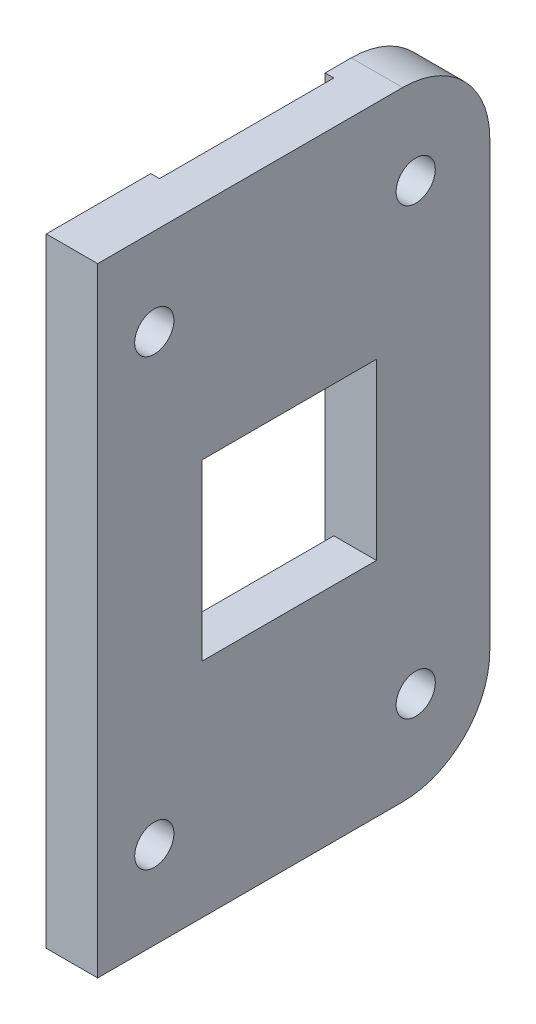
ISO-10303-21;
HEADER;
FILE_DESCRIPTION(('STEP AP214'),'2;1');
FILE_NAME('part.step','',(''),(''),'','','');
FILE_SCHEMA(('AUTOMOTIVE_DESIGN { 1 0 10303 214 1 1 1 1 }'));
ENDSEC;
DATA;
#1=APPLICATION_CONTEXT('core data for automotive mechanical design processes');
#2=APPLICATION_PROTOCOL_DEFINITION('international standard','automotive_design',2000,#1);
#3=PRODUCT_CONTEXT('',#1,'mechanical');
#4=PRODUCT('Part','Part','',(#3));
#5=PRODUCT_RELATED_PRODUCT_CATEGORY('part','',(#4));
#6=PRODUCT_DEFINITION_FORMATION('','',#4);
#7=PRODUCT_DEFINITION_CONTEXT('part definition',#1,'design');
#8=PRODUCT_DEFINITION('design','',#6,#7);
#9=PRODUCT_DEFINITION_SHAPE('','',#8);
#10=(LENGTH_UNIT() NAMED_UNIT(*) SI_UNIT(.MILLI.,.METRE.));
#11=(NAMED_UNIT(*) PLANE_ANGLE_UNIT() SI_UNIT($,.RADIAN.));
#12=(NAMED_UNIT(*) SI_UNIT($,.STERADIAN.) SOLID_ANGLE_UNIT());
#13=UNCERTAINTY_MEASURE_WITH_UNIT(LENGTH_MEASURE(1.E-05),#10,'distance_accuracy_value','');
#14=(GEOMETRIC_REPRESENTATION_CONTEXT(3) GLOBAL_UNCERTAINTY_ASSIGNED_CONTEXT((#13)) GLOBAL_UNIT_ASSIGNED_CONTEXT((#10,
#11,#12)) REPRESENTATION_CONTEXT('',''));
#15=CARTESIAN_POINT('',(0.,0.,0.));
#16=DIRECTION('',(0.,0.,1.));
#17=DIRECTION('',(1.,0.,0.));
#18=AXIS2_PLACEMENT_3D('',#15,#16,#17);
#19=CARTESIAN_POINT('',(0.999999999999998,71.001,-11.7999999999998));
#20=DIRECTION('',(1.,0.,0.));
#21=DIRECTION('',(0.,0.,-1.));
#22=AXIS2_PLACEMENT_3D('',#19,#20,#21);
#23=PLANE('',#22);
#24=DIRECTION('',(0.,-1.,0.));
#25=VECTOR('',#24,1.);
#26=CARTESIAN_POINT('',(0.999999999999998,71.001,8.20000000000018));
#27=LINE('',#26,#25);
#28=CARTESIAN_POINT('',(0.999999999999998,25.5,8.20000000000018));
#29=VERTEX_POINT('',#28);
#30=CARTESIAN_POINT('',(0.999999999999998,0.,8.20000000000018));
#31=VERTEX_POINT('',#30);
#32=EDGE_CURVE('E207',#29,#31,#27,.T.);
#33=ORIENTED_EDGE('',*,*,#32,.F.);
#34=DIRECTION('',(0.,0.,1.));
#35=VECTOR('',#34,1.);
#36=CARTESIAN_POINT('',(0.999999999999998,25.5,-11.7999999999998));
#37=LINE('',#36,#35);
#38=CARTESIAN_POINT('',(0.999999999999998,25.5,-11.7999999999998));
#39=VERTEX_POINT('',#38);
#40=EDGE_CURVE('E318',#39,#29,#37,.T.);
#41=ORIENTED_EDGE('',*,*,#40,.F.);
#42=DIRECTION('',(0.,-1.,0.));
#43=VECTOR('',#42,1.);
#44=CARTESIAN_POINT('',(0.999999999999998,71.001,-11.7999999999998));
#45=LINE('',#44,#43);
#46=CARTESIAN_POINT('',(0.999999999999998,0.,-11.7999999999998));
#47=VERTEX_POINT('',#46);
#48=EDGE_CURVE('E211',#39,#47,#45,.T.);
#49=ORIENTED_EDGE('',*,*,#48,.T.);
#50=DIRECTION('',(0.,0.,1.));
#51=VECTOR('',#50,1.);
#52=CARTESIAN_POINT('',(0.999999999999998,0.,-11.7999999999998));
#53=LINE('',#52,#51);
#54=EDGE_CURVE('E196',#47,#31,#53,.T.);
#55=ORIENTED_EDGE('',*,*,#54,.T.);
#56=EDGE_LOOP('',(#33,#41,#49,#55));
#57=FACE_BOUND('',#56,.T.);
#58=ADVANCED_FACE('F33',(#57),#23,.F.);
#59=CARTESIAN_POINT('',(0.,71.,-24.7999999999998));
#60=DIRECTION('',(1.,0.,0.));
#61=DIRECTION('',(0.,0.,-1.));
#62=AXIS2_PLACEMENT_3D('',#59,#60,#61);
#63=PLANE('',#62);
#64=CARTESIAN_POINT('',(0.,10.0000000000001,13.7000000000002));
#65=DIRECTION('',(1.,0.,0.));
#66=DIRECTION('',(0.,0.,-1.));
#67=AXIS2_PLACEMENT_3D('',#64,#65,#66);
#68=CIRCLE('',#67,2.24999999999995);
#69=CARTESIAN_POINT('',(0.,10.0000000000001,11.4500000000003));
#70=VERTEX_POINT('',#69);
#71=EDGE_CURVE('E167',#70,#70,#68,.F.);
#72=ORIENTED_EDGE('',*,*,#71,.F.);
#73=EDGE_LOOP('',(#72));
#74=FACE_BOUND('',#73,.T.);
#75=CARTESIAN_POINT('',(0.,61.0000000000001,13.7000000000002));
#76=DIRECTION('',(1.,0.,0.));
#77=DIRECTION('',(0.,0.,-1.));
#78=AXIS2_PLACEMENT_3D('',#75,#76,#77);
#79=CIRCLE('',#78,2.24999999999995);
#80=CARTESIAN_POINT('',(0.,61.0000000000001,11.4500000000003));
#81=VERTEX_POINT('',#80);
#82=EDGE_CURVE('E184',#81,#81,#79,.F.);
#83=ORIENTED_EDGE('',*,*,#82,.F.);
#84=EDGE_LOOP('',(#83));
#85=FACE_BOUND('',#84,.T.);
#86=DIRECTION('',(0.,0.,1.));
#87=VECTOR('',#86,1.);
#88=CARTESIAN_POINT('',(0.,71.,-24.7999999999998));
#89=LINE('',#88,#87);
#90=CARTESIAN_POINT('',(0.,71.,8.20000000000019));
#91=VERTEX_POINT('',#90);
#92=CARTESIAN_POINT('',(0.,71.,20.2000000000002));
#93=VERTEX_POINT('',#92);
#94=EDGE_CURVE('E220',#91,#93,#89,.T.);
#95=ORIENTED_EDGE('',*,*,#94,.F.);
#96=DIRECTION('',(0.,-1.,0.));
#97=VECTOR('',#96,1.);
#98=CARTESIAN_POINT('',(0.,71.001,8.20000000000018));
#99=LINE('',#98,#97);
#100=CARTESIAN_POINT('',(0.,0.,8.20000000000018));
#101=VERTEX_POINT('',#100);
#102=EDGE_CURVE('E202',#91,#101,#99,.T.);
#103=ORIENTED_EDGE('',*,*,#102,.T.);
#104=DIRECTION('',(0.,0.,1.));
#105=VECTOR('',#104,1.);
#106=CARTESIAN_POINT('',(0.,0.,-24.7999999999998));
#107=LINE('',#106,#105);
#108=CARTESIAN_POINT('',(0.,0.,20.2000000000002));
#109=VERTEX_POINT('',#108);
#110=EDGE_CURVE('E216',#101,#109,#107,.T.);
#111=ORIENTED_EDGE('',*,*,#110,.T.);
#112=DIRECTION('',(0.,-1.,0.));
#113=VECTOR('',#112,1.);
#114=CARTESIAN_POINT('',(0.,71.,20.2000000000002));
#115=LINE('',#114,#113);
#116=EDGE_CURVE('E238',#93,#109,#115,.T.);
#117=ORIENTED_EDGE('',*,*,#116,.F.);
#118=EDGE_LOOP('',(#95,#103,#111,#117));
#119=FACE_BOUND('',#118,.T.);
#120=ADVANCED_FACE('F297',(#74,#85,#119),#63,.F.);
#121=CARTESIAN_POINT('',(5.9,71.,-24.7999999999998));
#122=DIRECTION('',(0.,0.,1.));
#123=DIRECTION('',(1.,0.,0.));
#124=AXIS2_PLACEMENT_3D('',#121,#122,#123);
#125=PLANE('',#124);
#126=DIRECTION('',(0.,-1.,0.));
#127=VECTOR('',#126,1.);
#128=CARTESIAN_POINT('',(5.9,71.,-24.7999999999998));
#129=LINE('',#128,#127);
#130=CARTESIAN_POINT('',(5.9,61.,-24.7999999999998));
#131=VERTEX_POINT('',#130);
#132=CARTESIAN_POINT('',(5.9,10.,-24.7999999999998));
#133=VERTEX_POINT('',#132);
#134=EDGE_CURVE('E225',#131,#133,#129,.T.);
#135=ORIENTED_EDGE('',*,*,#134,.T.);
#136=DIRECTION('',(-1.,0.,0.));
#137=VECTOR('',#136,1.);
#138=CARTESIAN_POINT('',(5.9,10.,-24.7999999999998));
#139=LINE('',#138,#137);
#140=CARTESIAN_POINT('',(0.,10.,-24.7999999999998));
#141=VERTEX_POINT('',#140);
#142=EDGE_CURVE('E246',#133,#141,#139,.T.);
#143=ORIENTED_EDGE('',*,*,#142,.T.);
#144=DIRECTION('',(0.,-1.,0.));
#145=VECTOR('',#144,1.);
#146=CARTESIAN_POINT('',(0.,71.,-24.7999999999998));
#147=LINE('',#146,#145);
#148=CARTESIAN_POINT('',(0.,61.,-24.7999999999998));
#149=VERTEX_POINT('',#148);
#150=EDGE_CURVE('E241',#149,#141,#147,.T.);
#151=ORIENTED_EDGE('',*,*,#150,.F.);
#152=DIRECTION('',(-1.,0.,0.));
#153=VECTOR('',#152,1.);
#154=CARTESIAN_POINT('',(5.9,61.,-24.7999999999998));
#155=LINE('',#154,#153);
#156=EDGE_CURVE('E244',#149,#131,#155,.F.);
#157=ORIENTED_EDGE('',*,*,#156,.T.);
#158=EDGE_LOOP('',(#135,#143,#151,#157));
#159=FACE_BOUND('',#158,.T.);
#160=ADVANCED_FACE('F265',(#159),#125,.F.);
#161=CARTESIAN_POINT('',(0.,61.0000000000001,-16.2999999999998));
#162=DIRECTION('',(1.,0.,0.));
#163=DIRECTION('',(0.,0.,-1.));
#164=AXIS2_PLACEMENT_3D('',#161,#162,#163);
#165=CIRCLE('',#164,2.24999999999995);
#166=CARTESIAN_POINT('',(0.,61.0000000000001,-18.5499999999997));
#167=VERTEX_POINT('',#166);
#168=EDGE_CURVE('E175',#167,#167,#165,.F.);
#169=ORIENTED_EDGE('',*,*,#168,.F.);
#170=EDGE_LOOP('',(#169));
#171=FACE_BOUND('',#170,.T.);
#172=CARTESIAN_POINT('',(0.,10.0000000000001,-16.2999999999998));
#173=DIRECTION('',(1.,0.,0.));
#174=DIRECTION('',(0.,0.,-1.));
#175=AXIS2_PLACEMENT_3D('',#172,#173,#174);
#176=CIRCLE('',#175,2.24999999999995);
#177=CARTESIAN_POINT('',(0.,10.0000000000001,-18.5499999999997));
#178=VERTEX_POINT('',#177);
#179=EDGE_CURVE('E168',#178,#178,#176,.F.);
#180=ORIENTED_EDGE('',*,*,#179,.F.);
#181=EDGE_LOOP('',(#180));
#182=FACE_BOUND('',#181,.T.);
#183=ORIENTED_EDGE('',*,*,#150,.T.);
#184=CARTESIAN_POINT('',(0.,10.,-14.7999999999998));
#185=DIRECTION('',(1.,0.,0.));
#186=DIRECTION('',(0.,0.,-1.));
#187=AXIS2_PLACEMENT_3D('',#184,#185,#186);
#188=CIRCLE('',#187,10.);
#189=CARTESIAN_POINT('',(0.,0.,-14.7999999999998));
#190=VERTEX_POINT('',#189);
#191=EDGE_CURVE('E251',#141,#190,#188,.F.);
#192=ORIENTED_EDGE('',*,*,#191,.T.);
#193=CARTESIAN_POINT('',(0.,0.,-11.7999999999998));
#194=VERTEX_POINT('',#193);
#195=EDGE_CURVE('E226',#190,#194,#107,.T.);
#196=ORIENTED_EDGE('',*,*,#195,.T.);
#197=DIRECTION('',(0.,-1.,0.));
#198=VECTOR('',#197,1.);
#199=CARTESIAN_POINT('',(0.,71.001,-11.7999999999998));
#200=LINE('',#199,#198);
#201=CARTESIAN_POINT('',(0.,71.,-11.7999999999998));
#202=VERTEX_POINT('',#201);
#203=EDGE_CURVE('E201',#202,#194,#200,.T.);
#204=ORIENTED_EDGE('',*,*,#203,.F.);
#205=CARTESIAN_POINT('',(0.,71.,-14.7999999999998));
#206=VERTEX_POINT('',#205);
#207=EDGE_CURVE('E217',#206,#202,#89,.T.);
#208=ORIENTED_EDGE('',*,*,#207,.F.);
#209=CARTESIAN_POINT('',(0.,61.,-14.7999999999998));
#210=DIRECTION('',(1.,0.,0.));
#211=DIRECTION('',(0.,0.,-1.));
#212=AXIS2_PLACEMENT_3D('',#209,#210,#211);
#213=CIRCLE('',#212,10.);
#214=EDGE_CURVE('E249',#206,#149,#213,.F.);
#215=ORIENTED_EDGE('',*,*,#214,.T.);
#216=EDGE_LOOP('',(#183,#192,#196,#204,#208,#215));
#217=FACE_BOUND('',#216,.T.);
#218=ADVANCED_FACE('F271',(#171,#182,#217),#63,.F.);
#219=CARTESIAN_POINT('',(0.,71.,20.2000000000002));
#220=DIRECTION('',(0.,0.,-1.));
#221=DIRECTION('',(-1.,0.,0.));
#222=AXIS2_PLACEMENT_3D('',#219,#220,#221);
#223=PLANE('',#222);
#224=DIRECTION('',(1.,0.,0.));
#225=VECTOR('',#224,1.);
#226=CARTESIAN_POINT('',(0.,0.,20.2000000000002));
#227=LINE('',#226,#225);
#228=CARTESIAN_POINT('',(5.9,0.,20.2000000000002));
#229=VERTEX_POINT('',#228);
#230=EDGE_CURVE('E228',#109,#229,#227,.T.);
#231=ORIENTED_EDGE('',*,*,#230,.T.);
#232=DIRECTION('',(0.,-1.,0.));
#233=VECTOR('',#232,1.);
#234=CARTESIAN_POINT('',(5.9,71.,20.2000000000002));
#235=LINE('',#234,#233);
#236=CARTESIAN_POINT('',(5.9,71.,20.2000000000002));
#237=VERTEX_POINT('',#236);
#238=EDGE_CURVE('E235',#237,#229,#235,.T.);
#239=ORIENTED_EDGE('',*,*,#238,.F.);
#240=DIRECTION('',(1.,0.,0.));
#241=VECTOR('',#240,1.);
#242=CARTESIAN_POINT('',(0.,71.,20.2000000000002));
#243=LINE('',#242,#241);
#244=EDGE_CURVE('E219',#93,#237,#243,.T.);
#245=ORIENTED_EDGE('',*,*,#244,.F.);
#246=ORIENTED_EDGE('',*,*,#116,.T.);
#247=EDGE_LOOP('',(#231,#239,#245,#246));
#248=FACE_BOUND('',#247,.T.);
#249=ADVANCED_FACE('F293',(#248),#223,.F.);
#250=CARTESIAN_POINT('',(5.9,71.,20.2000000000002));
#251=DIRECTION('',(-1.,0.,0.));
#252=DIRECTION('',(0.,0.,1.));
#253=AXIS2_PLACEMENT_3D('',#250,#251,#252);
#254=PLANE('',#253);
#255=DIRECTION('',(0.,0.,1.));
#256=VECTOR('',#255,1.);
#257=CARTESIAN_POINT('',(5.9,45.5,-11.7999999999998));
#258=LINE('',#257,#256);
#259=CARTESIAN_POINT('',(5.9,45.5,-11.7999999999998));
#260=VERTEX_POINT('',#259);
#261=CARTESIAN_POINT('',(5.9,45.5,8.20000000000018));
#262=VERTEX_POINT('',#261);
#263=EDGE_CURVE('E146',#260,#262,#258,.T.);
#264=ORIENTED_EDGE('',*,*,#263,.F.);
#265=DIRECTION('',(0.,1.,0.));
#266=VECTOR('',#265,1.);
#267=CARTESIAN_POINT('',(5.9,45.5,-11.7999999999998));
#268=LINE('',#267,#266);
#269=CARTESIAN_POINT('',(5.9,25.5,-11.7999999999998));
#270=VERTEX_POINT('',#269);
#271=EDGE_CURVE('E48',#270,#260,#268,.T.);
#272=ORIENTED_EDGE('',*,*,#271,.F.);
#273=DIRECTION('',(0.,0.,-1.));
#274=VECTOR('',#273,1.);
#275=CARTESIAN_POINT('',(5.9,25.5,-11.7999999999998));
#276=LINE('',#275,#274);
#277=CARTESIAN_POINT('',(5.9,25.5,8.20000000000018));
#278=VERTEX_POINT('',#277);
#279=EDGE_CURVE('E153',#278,#270,#276,.T.);
#280=ORIENTED_EDGE('',*,*,#279,.F.);
#281=DIRECTION('',(0.,-1.,0.));
#282=VECTOR('',#281,1.);
#283=CARTESIAN_POINT('',(5.9,45.5,8.20000000000018));
#284=LINE('',#283,#282);
#285=EDGE_CURVE('E138',#262,#278,#284,.T.);
#286=ORIENTED_EDGE('',*,*,#285,.F.);
#287=EDGE_LOOP('',(#264,#272,#280,#286));
#288=FACE_BOUND('',#287,.T.);
#289=CARTESIAN_POINT('',(5.9,61.0000000000001,-16.2999999999998));
#290=DIRECTION('',(1.,0.,0.));
#291=DIRECTION('',(0.,0.,-1.));
#292=AXIS2_PLACEMENT_3D('',#289,#290,#291);
#293=CIRCLE('',#292,2.24999999999995);
#294=CARTESIAN_POINT('',(5.9,61.0000000000001,-18.5499999999997));
#295=VERTEX_POINT('',#294);
#296=EDGE_CURVE('E163',#295,#295,#293,.T.);
#297=ORIENTED_EDGE('',*,*,#296,.F.);
#298=EDGE_LOOP('',(#297));
#299=FACE_BOUND('',#298,.T.);
#300=CARTESIAN_POINT('',(5.9,10.0000000000001,-16.2999999999998));
#301=DIRECTION('',(1.,0.,0.));
#302=DIRECTION('',(0.,0.,-1.));
#303=AXIS2_PLACEMENT_3D('',#300,#301,#302);
#304=CIRCLE('',#303,2.24999999999995);
#305=CARTESIAN_POINT('',(5.9,10.0000000000001,-18.5499999999997));
#306=VERTEX_POINT('',#305);
#307=EDGE_CURVE('E172',#306,#306,#304,.T.);
#308=ORIENTED_EDGE('',*,*,#307,.F.);
#309=EDGE_LOOP('',(#308));
#310=FACE_BOUND('',#309,.T.);
#311=CARTESIAN_POINT('',(5.9,10.0000000000001,13.7000000000002));
#312=DIRECTION('',(1.,0.,0.));
#313=DIRECTION('',(0.,0.,-1.));
#314=AXIS2_PLACEMENT_3D('',#311,#312,#313);
#315=CIRCLE('',#314,2.24999999999995);
#316=CARTESIAN_POINT('',(5.9,10.0000000000001,11.4500000000003));
#317=VERTEX_POINT('',#316);
#318=EDGE_CURVE('E164',#317,#317,#315,.T.);
#319=ORIENTED_EDGE('',*,*,#318,.F.);
#320=EDGE_LOOP('',(#319));
#321=FACE_BOUND('',#320,.T.);
#322=CARTESIAN_POINT('',(5.9,61.0000000000001,13.7000000000002));
#323=DIRECTION('',(1.,0.,0.));
#324=DIRECTION('',(0.,0.,-1.));
#325=AXIS2_PLACEMENT_3D('',#322,#323,#324);
#326=CIRCLE('',#325,2.24999999999995);
#327=CARTESIAN_POINT('',(5.9,61.0000000000001,11.4500000000003));
#328=VERTEX_POINT('',#327);
#329=EDGE_CURVE('E171',#328,#328,#326,.T.);
#330=ORIENTED_EDGE('',*,*,#329,.F.);
#331=EDGE_LOOP('',(#330));
#332=FACE_BOUND('',#331,.T.);
#333=DIRECTION('',(0.,0.,-1.));
#334=VECTOR('',#333,1.);
#335=CARTESIAN_POINT('',(5.9,0.,20.2000000000002));
#336=LINE('',#335,#334);
#337=CARTESIAN_POINT('',(5.9,0.,-14.7999999999998));
#338=VERTEX_POINT('',#337);
#339=EDGE_CURVE('E230',#229,#338,#336,.T.);
#340=ORIENTED_EDGE('',*,*,#339,.T.);
#341=CARTESIAN_POINT('',(5.9,10.,-14.7999999999998));
#342=DIRECTION('',(-1.,0.,0.));
#343=DIRECTION('',(0.,0.,1.));
#344=AXIS2_PLACEMENT_3D('',#341,#342,#343);
#345=CIRCLE('',#344,10.);
#346=EDGE_CURVE('E41',#338,#133,#345,.F.);
#347=ORIENTED_EDGE('',*,*,#346,.T.);
#348=ORIENTED_EDGE('',*,*,#134,.F.);
#349=CARTESIAN_POINT('',(5.9,61.,-14.7999999999998));
#350=DIRECTION('',(-1.,0.,0.));
#351=DIRECTION('',(0.,0.,1.));
#352=AXIS2_PLACEMENT_3D('',#349,#350,#351);
#353=CIRCLE('',#352,10.);
#354=CARTESIAN_POINT('',(5.9,71.,-14.7999999999998));
#355=VERTEX_POINT('',#354);
#356=EDGE_CURVE('E255',#131,#355,#353,.F.);
#357=ORIENTED_EDGE('',*,*,#356,.T.);
#358=DIRECTION('',(0.,0.,-1.));
#359=VECTOR('',#358,1.);
#360=CARTESIAN_POINT('',(5.9,71.,20.2000000000002));
#361=LINE('',#360,#359);
#362=EDGE_CURVE('E222',#237,#355,#361,.T.);
#363=ORIENTED_EDGE('',*,*,#362,.F.);
#364=ORIENTED_EDGE('',*,*,#238,.T.);
#365=EDGE_LOOP('',(#340,#347,#348,#357,#363,#364));
#366=FACE_BOUND('',#365,.T.);
#367=ADVANCED_FACE('F150',(#288,#299,#310,#321,#332,#366),#254,.F.);
#368=CARTESIAN_POINT('',(0.,71.,0.));
#369=DIRECTION('',(0.,1.,0.));
#370=DIRECTION('',(0.,0.,1.));
#371=AXIS2_PLACEMENT_3D('',#368,#369,#370);
#372=PLANE('',#371);
#373=ORIENTED_EDGE('',*,*,#362,.T.);
#374=DIRECTION('',(-1.,0.,0.));
#375=VECTOR('',#374,1.);
#376=CARTESIAN_POINT('',(0.,71.,-14.7999999999998));
#377=LINE('',#376,#375);
#378=EDGE_CURVE('E11',#355,#206,#377,.T.);
#379=ORIENTED_EDGE('',*,*,#378,.T.);
#380=ORIENTED_EDGE('',*,*,#207,.T.);
#381=DIRECTION('',(1.,0.,0.));
#382=VECTOR('',#381,1.);
#383=CARTESIAN_POINT('',(0.,71.,-11.7999999999998));
#384=LINE('',#383,#382);
#385=CARTESIAN_POINT('',(0.999999999999998,71.,-11.7999999999998));
#386=VERTEX_POINT('',#385);
#387=EDGE_CURVE('E205',#202,#386,#384,.T.);
#388=ORIENTED_EDGE('',*,*,#387,.T.);
#389=DIRECTION('',(0.,0.,1.));
#390=VECTOR('',#389,1.);
#391=CARTESIAN_POINT('',(0.999999999999998,71.,-11.7999999999998));
#392=LINE('',#391,#390);
#393=CARTESIAN_POINT('',(0.999999999999998,71.,8.20000000000018));
#394=VERTEX_POINT('',#393);
#395=EDGE_CURVE('E187',#386,#394,#392,.T.);
#396=ORIENTED_EDGE('',*,*,#395,.T.);
#397=DIRECTION('',(-1.,0.,0.));
#398=VECTOR('',#397,1.);
#399=CARTESIAN_POINT('',(0.,71.,8.20000000000018));
#400=LINE('',#399,#398);
#401=EDGE_CURVE('E190',#394,#91,#400,.T.);
#402=ORIENTED_EDGE('',*,*,#401,.T.);
#403=ORIENTED_EDGE('',*,*,#94,.T.);
#404=ORIENTED_EDGE('',*,*,#244,.T.);
#405=EDGE_LOOP('',(#373,#379,#380,#388,#396,#402,#403,#404));
#406=FACE_BOUND('',#405,.T.);
#407=ADVANCED_FACE('F284',(#406),#372,.T.);
#408=CARTESIAN_POINT('',(0.,0.,0.));
#409=DIRECTION('',(0.,1.,0.));
#410=DIRECTION('',(0.,0.,1.));
#411=AXIS2_PLACEMENT_3D('',#408,#409,#410);
#412=PLANE('',#411);
#413=ORIENTED_EDGE('',*,*,#195,.F.);
#414=DIRECTION('',(-1.,0.,0.));
#415=VECTOR('',#414,1.);
#416=CARTESIAN_POINT('',(0.,0.,-14.7999999999998));
#417=LINE('',#416,#415);
#418=EDGE_CURVE('E253',#190,#338,#417,.F.);
#419=ORIENTED_EDGE('',*,*,#418,.T.);
#420=ORIENTED_EDGE('',*,*,#339,.F.);
#421=ORIENTED_EDGE('',*,*,#230,.F.);
#422=ORIENTED_EDGE('',*,*,#110,.F.);
#423=DIRECTION('',(-1.,0.,0.));
#424=VECTOR('',#423,1.);
#425=CARTESIAN_POINT('',(0.,0.,8.20000000000018));
#426=LINE('',#425,#424);
#427=EDGE_CURVE('E199',#31,#101,#426,.T.);
#428=ORIENTED_EDGE('',*,*,#427,.F.);
#429=ORIENTED_EDGE('',*,*,#54,.F.);
#430=DIRECTION('',(1.,0.,0.));
#431=VECTOR('',#430,1.);
#432=CARTESIAN_POINT('',(0.,0.,-11.7999999999998));
#433=LINE('',#432,#431);
#434=EDGE_CURVE('E193',#194,#47,#433,.T.);
#435=ORIENTED_EDGE('',*,*,#434,.F.);
#436=EDGE_LOOP('',(#413,#419,#420,#421,#422,#428,#429,#435));
#437=FACE_BOUND('',#436,.T.);
#438=ADVANCED_FACE('F275',(#437),#412,.F.);
#439=CARTESIAN_POINT('',(0.,71.001,8.20000000000018));
#440=DIRECTION('',(0.,0.,1.));
#441=DIRECTION('',(1.,0.,0.));
#442=AXIS2_PLACEMENT_3D('',#439,#440,#441);
#443=PLANE('',#442);
#444=CARTESIAN_POINT('',(0.999999999999998,45.5,8.20000000000018));
#445=VERTEX_POINT('',#444);
#446=EDGE_CURVE('E141',#394,#445,#27,.T.);
#447=ORIENTED_EDGE('',*,*,#446,.T.);
#448=DIRECTION('',(1.,0.,0.));
#449=VECTOR('',#448,1.);
#450=CARTESIAN_POINT('',(-0.00100000000000187,45.5,8.20000000000018));
#451=LINE('',#450,#449);
#452=EDGE_CURVE('E134',#445,#262,#451,.T.);
#453=ORIENTED_EDGE('',*,*,#452,.T.);
#454=ORIENTED_EDGE('',*,*,#285,.T.);
#455=DIRECTION('',(1.,0.,0.));
#456=VECTOR('',#455,1.);
#457=CARTESIAN_POINT('',(-0.00100000000000187,25.5,8.20000000000018));
#458=LINE('',#457,#456);
#459=EDGE_CURVE('E142',#29,#278,#458,.T.);
#460=ORIENTED_EDGE('',*,*,#459,.F.);
#461=ORIENTED_EDGE('',*,*,#32,.T.);
#462=ORIENTED_EDGE('',*,*,#427,.T.);
#463=ORIENTED_EDGE('',*,*,#102,.F.);
#464=ORIENTED_EDGE('',*,*,#401,.F.);
#465=EDGE_LOOP('',(#447,#453,#454,#460,#461,#462,#463,#464));
#466=FACE_BOUND('',#465,.T.);
#467=ADVANCED_FACE('F136',(#466),#443,.F.);
#468=CARTESIAN_POINT('',(0.999999999999998,45.5,-11.7999999999998));
#469=VERTEX_POINT('',#468);
#470=EDGE_CURVE('E208',#386,#469,#45,.T.);
#471=ORIENTED_EDGE('',*,*,#470,.T.);
#472=DIRECTION('',(0.,0.,-1.));
#473=VECTOR('',#472,1.);
#474=CARTESIAN_POINT('',(0.999999999999998,45.5,-11.7999999999998));
#475=LINE('',#474,#473);
#476=EDGE_CURVE('E55',#445,#469,#475,.T.);
#477=ORIENTED_EDGE('',*,*,#476,.F.);
#478=ORIENTED_EDGE('',*,*,#446,.F.);
#479=ORIENTED_EDGE('',*,*,#395,.F.);
#480=EDGE_LOOP('',(#471,#477,#478,#479));
#481=FACE_BOUND('',#480,.T.);
#482=ADVANCED_FACE('F299',(#481),#23,.F.);
#483=CARTESIAN_POINT('',(0.,71.001,-11.7999999999998));
#484=DIRECTION('',(0.,0.,-1.));
#485=DIRECTION('',(-1.,0.,0.));
#486=AXIS2_PLACEMENT_3D('',#483,#484,#485);
#487=PLANE('',#486);
#488=ORIENTED_EDGE('',*,*,#203,.T.);
#489=ORIENTED_EDGE('',*,*,#434,.T.);
#490=ORIENTED_EDGE('',*,*,#48,.F.);
#491=DIRECTION('',(1.,0.,0.));
#492=VECTOR('',#491,1.);
#493=CARTESIAN_POINT('',(-0.00100000000000187,25.5,-11.7999999999998));
#494=LINE('',#493,#492);
#495=EDGE_CURVE('E158',#39,#270,#494,.T.);
#496=ORIENTED_EDGE('',*,*,#495,.T.);
#497=ORIENTED_EDGE('',*,*,#271,.T.);
#498=DIRECTION('',(1.,0.,0.));
#499=VECTOR('',#498,1.);
#500=CARTESIAN_POINT('',(-0.00100000000000187,45.5,-11.7999999999998));
#501=LINE('',#500,#499);
#502=EDGE_CURVE('E143',#469,#260,#501,.T.);
#503=ORIENTED_EDGE('',*,*,#502,.F.);
#504=ORIENTED_EDGE('',*,*,#470,.F.);
#505=ORIENTED_EDGE('',*,*,#387,.F.);
#506=EDGE_LOOP('',(#488,#489,#490,#496,#497,#503,#504,#505));
#507=FACE_BOUND('',#506,.T.);
#508=ADVANCED_FACE('F279',(#507),#487,.F.);
#509=CARTESIAN_POINT('',(5.9,10.,-14.7999999999998));
#510=DIRECTION('',(-1.,0.,0.));
#511=DIRECTION('',(0.,0.,1.));
#512=AXIS2_PLACEMENT_3D('',#509,#510,#511);
#513=CYLINDRICAL_SURFACE('',#512,10.);
#514=ORIENTED_EDGE('',*,*,#346,.F.);
#515=ORIENTED_EDGE('',*,*,#418,.F.);
#516=ORIENTED_EDGE('',*,*,#191,.F.);
#517=ORIENTED_EDGE('',*,*,#142,.F.);
#518=EDGE_LOOP('',(#514,#515,#516,#517));
#519=FACE_BOUND('',#518,.T.);
#520=ADVANCED_FACE('F268',(#519),#513,.T.);
#521=CARTESIAN_POINT('',(0.,61.,-14.7999999999998));
#522=DIRECTION('',(1.,0.,0.));
#523=DIRECTION('',(0.,0.,-1.));
#524=AXIS2_PLACEMENT_3D('',#521,#522,#523);
#525=CYLINDRICAL_SURFACE('',#524,10.);
#526=ORIENTED_EDGE('',*,*,#356,.F.);
#527=ORIENTED_EDGE('',*,*,#156,.F.);
#528=ORIENTED_EDGE('',*,*,#214,.F.);
#529=ORIENTED_EDGE('',*,*,#378,.F.);
#530=EDGE_LOOP('',(#526,#527,#528,#529));
#531=FACE_BOUND('',#530,.T.);
#532=ADVANCED_FACE('F35',(#531),#525,.T.);
#533=CARTESIAN_POINT('',(-0.00100000000000187,61.0000000000001,13.7000000000002));
#534=DIRECTION('',(1.,0.,0.));
#535=DIRECTION('',(0.,0.,-1.));
#536=AXIS2_PLACEMENT_3D('',#533,#534,#535);
#537=CYLINDRICAL_SURFACE('',#536,2.24999999999995);
#538=ORIENTED_EDGE('',*,*,#329,.T.);
#539=EDGE_LOOP('',(#538));
#540=FACE_BOUND('',#539,.T.);
#541=ORIENTED_EDGE('',*,*,#82,.T.);
#542=EDGE_LOOP('',(#541));
#543=FACE_BOUND('',#542,.T.);
#544=ADVANCED_FACE('F337',(#540,#543),#537,.F.);
#545=CARTESIAN_POINT('',(-0.00100000000000187,10.0000000000001,13.7000000000002));
#546=DIRECTION('',(1.,0.,0.));
#547=DIRECTION('',(0.,0.,-1.));
#548=AXIS2_PLACEMENT_3D('',#545,#546,#547);
#549=CYLINDRICAL_SURFACE('',#548,2.24999999999995);
#550=ORIENTED_EDGE('',*,*,#318,.T.);
#551=EDGE_LOOP('',(#550));
#552=FACE_BOUND('',#551,.T.);
#553=ORIENTED_EDGE('',*,*,#71,.T.);
#554=EDGE_LOOP('',(#553));
#555=FACE_BOUND('',#554,.T.);
#556=ADVANCED_FACE('F334',(#552,#555),#549,.F.);
#557=CARTESIAN_POINT('',(-0.00100000000000187,10.0000000000001,-16.2999999999998));
#558=DIRECTION('',(1.,0.,0.));
#559=DIRECTION('',(0.,0.,-1.));
#560=AXIS2_PLACEMENT_3D('',#557,#558,#559);
#561=CYLINDRICAL_SURFACE('',#560,2.24999999999995);
#562=ORIENTED_EDGE('',*,*,#307,.T.);
#563=EDGE_LOOP('',(#562));
#564=FACE_BOUND('',#563,.T.);
#565=ORIENTED_EDGE('',*,*,#179,.T.);
#566=EDGE_LOOP('',(#565));
#567=FACE_BOUND('',#566,.T.);
#568=ADVANCED_FACE('F330',(#564,#567),#561,.F.);
#569=CARTESIAN_POINT('',(-0.00100000000000187,61.0000000000001,-16.2999999999998));
#570=DIRECTION('',(1.,0.,0.));
#571=DIRECTION('',(0.,0.,-1.));
#572=AXIS2_PLACEMENT_3D('',#569,#570,#571);
#573=CYLINDRICAL_SURFACE('',#572,2.24999999999995);
#574=ORIENTED_EDGE('',*,*,#296,.T.);
#575=EDGE_LOOP('',(#574));
#576=FACE_BOUND('',#575,.T.);
#577=ORIENTED_EDGE('',*,*,#168,.T.);
#578=EDGE_LOOP('',(#577));
#579=FACE_BOUND('',#578,.T.);
#580=ADVANCED_FACE('F323',(#576,#579),#573,.F.);
#581=CARTESIAN_POINT('',(-0.00100000000000187,25.5,-11.7999999999998));
#582=DIRECTION('',(0.,-1.,0.));
#583=DIRECTION('',(0.,0.,-1.));
#584=AXIS2_PLACEMENT_3D('',#581,#582,#583);
#585=PLANE('',#584);
#586=ORIENTED_EDGE('',*,*,#40,.T.);
#587=ORIENTED_EDGE('',*,*,#459,.T.);
#588=ORIENTED_EDGE('',*,*,#279,.T.);
#589=ORIENTED_EDGE('',*,*,#495,.F.);
#590=EDGE_LOOP('',(#586,#587,#588,#589));
#591=FACE_BOUND('',#590,.T.);
#592=ADVANCED_FACE('F320',(#591),#585,.F.);
#593=CARTESIAN_POINT('',(-0.00100000000000187,45.5,-11.7999999999998));
#594=DIRECTION('',(0.,1.,0.));
#595=DIRECTION('',(0.,0.,1.));
#596=AXIS2_PLACEMENT_3D('',#593,#594,#595);
#597=PLANE('',#596);
#598=ORIENTED_EDGE('',*,*,#476,.T.);
#599=ORIENTED_EDGE('',*,*,#502,.T.);
#600=ORIENTED_EDGE('',*,*,#263,.T.);
#601=ORIENTED_EDGE('',*,*,#452,.F.);
#602=EDGE_LOOP('',(#598,#599,#600,#601));
#603=FACE_BOUND('',#602,.T.);
#604=ADVANCED_FACE('F147',(#603),#597,.F.);
#605=CLOSED_SHELL('',(#58,#120,#160,#218,#249,#367,#407,#438,#467,#482,#508,#520,#532,#544,#556,
#568,#580,#592,#604));
#606=MANIFOLD_SOLID_BREP('B2',#605);
#607=ADVANCED_BREP_SHAPE_REPRESENTATION('',(#18,#606),#14);
#608=SHAPE_DEFINITION_REPRESENTATION(#9,#607);
ENDSEC;
END-ISO-10303-21;
